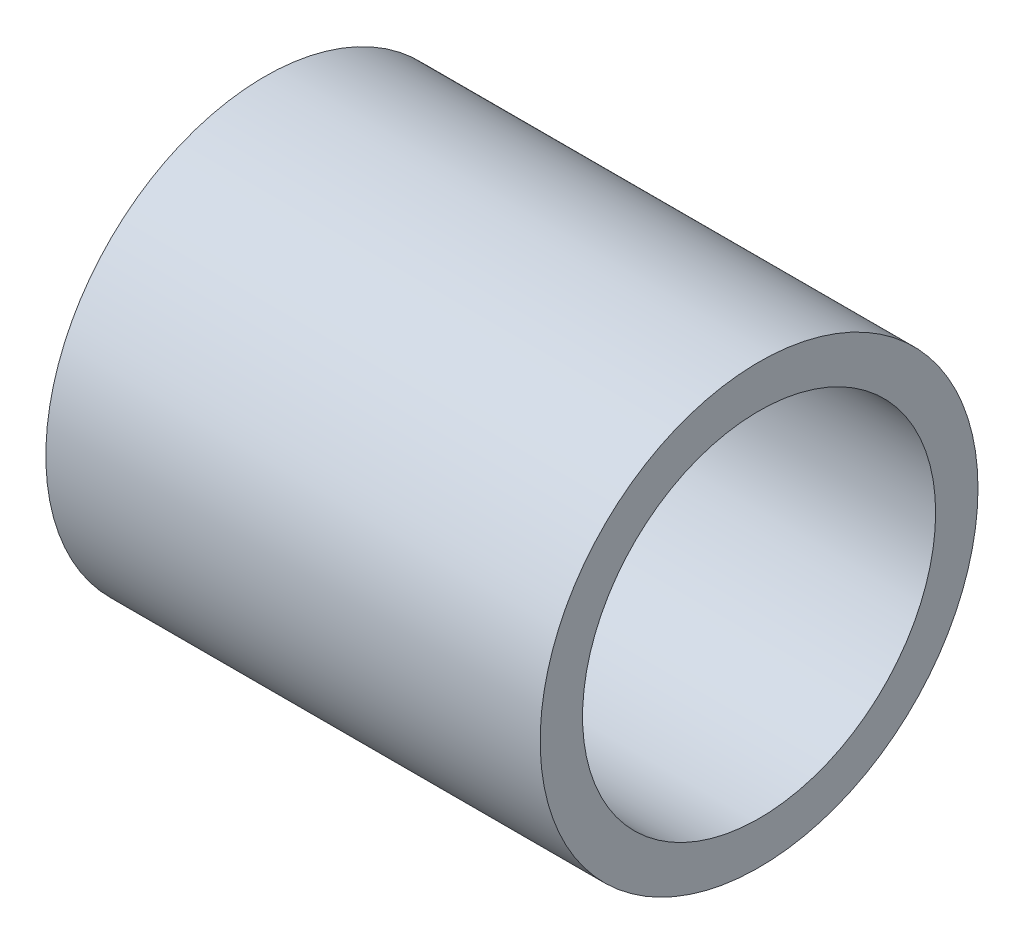
ISO-10303-21;
HEADER;
FILE_DESCRIPTION(('STEP AP214'),'2;1');
FILE_NAME('part.step','',(''),(''),'','','');
FILE_SCHEMA(('AUTOMOTIVE_DESIGN { 1 0 10303 214 1 1 1 1 }'));
ENDSEC;
DATA;
#1=APPLICATION_CONTEXT('core data for automotive mechanical design processes');
#2=APPLICATION_PROTOCOL_DEFINITION('international standard','automotive_design',2000,#1);
#3=PRODUCT_CONTEXT('',#1,'mechanical');
#4=PRODUCT('Part','Part','',(#3));
#5=PRODUCT_RELATED_PRODUCT_CATEGORY('part','',(#4));
#6=PRODUCT_DEFINITION_FORMATION('','',#4);
#7=PRODUCT_DEFINITION_CONTEXT('part definition',#1,'design');
#8=PRODUCT_DEFINITION('design','',#6,#7);
#9=PRODUCT_DEFINITION_SHAPE('','',#8);
#10=(LENGTH_UNIT() NAMED_UNIT(*) SI_UNIT(.MILLI.,.METRE.));
#11=(NAMED_UNIT(*) PLANE_ANGLE_UNIT() SI_UNIT($,.RADIAN.));
#12=(NAMED_UNIT(*) SI_UNIT($,.STERADIAN.) SOLID_ANGLE_UNIT());
#13=UNCERTAINTY_MEASURE_WITH_UNIT(LENGTH_MEASURE(1.E-05),#10,'distance_accuracy_value','');
#14=(GEOMETRIC_REPRESENTATION_CONTEXT(3) GLOBAL_UNCERTAINTY_ASSIGNED_CONTEXT((#13)) GLOBAL_UNIT_ASSIGNED_CONTEXT((#10,
#11,#12)) REPRESENTATION_CONTEXT('',''));
#15=CARTESIAN_POINT('',(0.,0.,0.));
#16=DIRECTION('',(0.,0.,1.));
#17=DIRECTION('',(1.,0.,0.));
#18=AXIS2_PLACEMENT_3D('',#15,#16,#17);
#19=CARTESIAN_POINT('',(35.,0.,0.));
#20=DIRECTION('',(1.,0.,0.));
#21=DIRECTION('',(0.,0.,-1.));
#22=AXIS2_PLACEMENT_3D('',#19,#20,#21);
#23=PLANE('',#22);
#24=CARTESIAN_POINT('',(35.,0.,0.));
#25=DIRECTION('',(1.,0.,0.));
#26=DIRECTION('',(0.,0.,-1.));
#27=AXIS2_PLACEMENT_3D('',#24,#25,#26);
#28=CIRCLE('',#27,15.5);
#29=CARTESIAN_POINT('',(35.,0.,-15.5));
#30=VERTEX_POINT('',#29);
#31=EDGE_CURVE('E10',#30,#30,#28,.T.);
#32=ORIENTED_EDGE('',*,*,#31,.T.);
#33=EDGE_LOOP('',(#32));
#34=FACE_BOUND('',#33,.T.);
#35=CARTESIAN_POINT('',(35.,0.,0.));
#36=DIRECTION('',(1.,0.,0.));
#37=DIRECTION('',(0.,0.,-1.));
#38=AXIS2_PLACEMENT_3D('',#35,#36,#37);
#39=CIRCLE('',#38,12.5);
#40=CARTESIAN_POINT('',(35.,0.,-12.5));
#41=VERTEX_POINT('',#40);
#42=EDGE_CURVE('E43',#41,#41,#39,.T.);
#43=ORIENTED_EDGE('',*,*,#42,.F.);
#44=EDGE_LOOP('',(#43));
#45=FACE_BOUND('',#44,.T.);
#46=ADVANCED_FACE('F32',(#34,#45),#23,.T.);
#47=CARTESIAN_POINT('',(0.,0.,0.));
#48=DIRECTION('',(1.,0.,0.));
#49=DIRECTION('',(0.,0.,-1.));
#50=AXIS2_PLACEMENT_3D('',#47,#48,#49);
#51=PLANE('',#50);
#52=CARTESIAN_POINT('',(0.,0.,0.));
#53=DIRECTION('',(1.,0.,0.));
#54=DIRECTION('',(0.,0.,-1.));
#55=AXIS2_PLACEMENT_3D('',#52,#53,#54);
#56=CIRCLE('',#55,15.5);
#57=CARTESIAN_POINT('',(0.,0.,-15.5));
#58=VERTEX_POINT('',#57);
#59=EDGE_CURVE('E36',#58,#58,#56,.T.);
#60=ORIENTED_EDGE('',*,*,#59,.F.);
#61=EDGE_LOOP('',(#60));
#62=FACE_BOUND('',#61,.T.);
#63=CARTESIAN_POINT('',(0.,0.,0.));
#64=DIRECTION('',(1.,0.,0.));
#65=DIRECTION('',(0.,0.,-1.));
#66=AXIS2_PLACEMENT_3D('',#63,#64,#65);
#67=CIRCLE('',#66,12.5);
#68=CARTESIAN_POINT('',(0.,0.,-12.5));
#69=VERTEX_POINT('',#68);
#70=EDGE_CURVE('E45',#69,#69,#67,.T.);
#71=ORIENTED_EDGE('',*,*,#70,.T.);
#72=EDGE_LOOP('',(#71));
#73=FACE_BOUND('',#72,.T.);
#74=ADVANCED_FACE('F55',(#62,#73),#51,.F.);
#75=CARTESIAN_POINT('',(35.,0.,0.));
#76=DIRECTION('',(-1.,0.,0.));
#77=DIRECTION('',(0.,0.,1.));
#78=AXIS2_PLACEMENT_3D('',#75,#76,#77);
#79=CYLINDRICAL_SURFACE('',#78,15.5);
#80=ORIENTED_EDGE('',*,*,#31,.F.);
#81=EDGE_LOOP('',(#80));
#82=FACE_BOUND('',#81,.T.);
#83=ORIENTED_EDGE('',*,*,#59,.T.);
#84=EDGE_LOOP('',(#83));
#85=FACE_BOUND('',#84,.T.);
#86=ADVANCED_FACE('F34',(#82,#85),#79,.T.);
#87=CARTESIAN_POINT('',(35.,0.,0.));
#88=DIRECTION('',(-1.,0.,0.));
#89=DIRECTION('',(0.,0.,1.));
#90=AXIS2_PLACEMENT_3D('',#87,#88,#89);
#91=CYLINDRICAL_SURFACE('',#90,12.5);
#92=ORIENTED_EDGE('',*,*,#42,.T.);
#93=EDGE_LOOP('',(#92));
#94=FACE_BOUND('',#93,.T.);
#95=ORIENTED_EDGE('',*,*,#70,.F.);
#96=EDGE_LOOP('',(#95));
#97=FACE_BOUND('',#96,.T.);
#98=ADVANCED_FACE('F51',(#94,#97),#91,.F.);
#99=CLOSED_SHELL('',(#46,#74,#86,#98));
#100=MANIFOLD_SOLID_BREP('B2',#99);
#101=ADVANCED_BREP_SHAPE_REPRESENTATION('',(#18,#100),#14);
#102=SHAPE_DEFINITION_REPRESENTATION(#9,#101);
ENDSEC;
END-ISO-10303-21;
